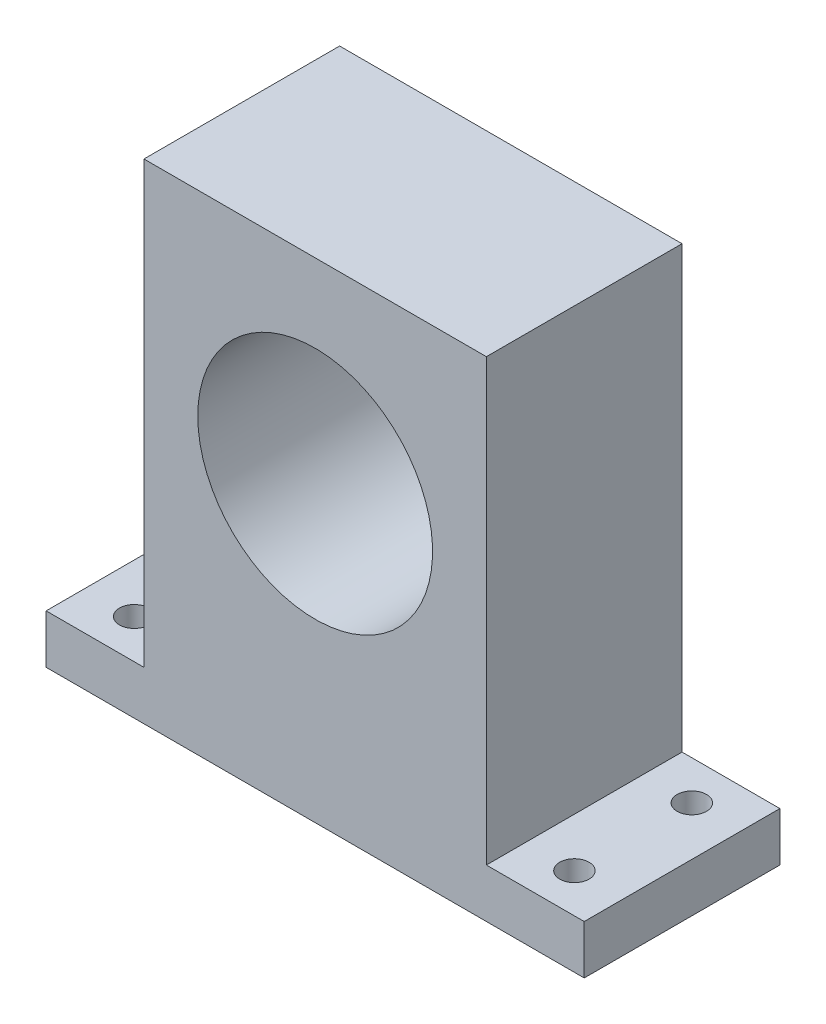
ISO-10303-21;
HEADER;
FILE_DESCRIPTION(('STEP AP214'),'2;1');
FILE_NAME('part.step','',(''),(''),'','','');
FILE_SCHEMA(('AUTOMOTIVE_DESIGN { 1 0 10303 214 1 1 1 1 }'));
ENDSEC;
DATA;
#1=APPLICATION_CONTEXT('core data for automotive mechanical design processes');
#2=APPLICATION_PROTOCOL_DEFINITION('international standard','automotive_design',2000,#1);
#3=PRODUCT_CONTEXT('',#1,'mechanical');
#4=PRODUCT('Part','Part','',(#3));
#5=PRODUCT_RELATED_PRODUCT_CATEGORY('part','',(#4));
#6=PRODUCT_DEFINITION_FORMATION('','',#4);
#7=PRODUCT_DEFINITION_CONTEXT('part definition',#1,'design');
#8=PRODUCT_DEFINITION('design','',#6,#7);
#9=PRODUCT_DEFINITION_SHAPE('','',#8);
#10=(LENGTH_UNIT() NAMED_UNIT(*) SI_UNIT(.MILLI.,.METRE.));
#11=(NAMED_UNIT(*) PLANE_ANGLE_UNIT() SI_UNIT($,.RADIAN.));
#12=(NAMED_UNIT(*) SI_UNIT($,.STERADIAN.) SOLID_ANGLE_UNIT());
#13=UNCERTAINTY_MEASURE_WITH_UNIT(LENGTH_MEASURE(1.E-05),#10,'distance_accuracy_value','');
#14=(GEOMETRIC_REPRESENTATION_CONTEXT(3) GLOBAL_UNCERTAINTY_ASSIGNED_CONTEXT((#13)) GLOBAL_UNIT_ASSIGNED_CONTEXT((#10,
#11,#12)) REPRESENTATION_CONTEXT('',''));
#15=CARTESIAN_POINT('',(0.,0.,0.));
#16=DIRECTION('',(0.,0.,1.));
#17=DIRECTION('',(1.,0.,0.));
#18=AXIS2_PLACEMENT_3D('',#15,#16,#17);
#19=CARTESIAN_POINT('',(-17.5,25.,20.));
#20=DIRECTION('',(1.,0.,0.));
#21=DIRECTION('',(0.,1.,0.));
#22=AXIS2_PLACEMENT_3D('',#19,#20,#21);
#23=PLANE('',#22);
#24=DIRECTION('',(0.,0.,-1.));
#25=VECTOR('',#24,1.);
#26=CARTESIAN_POINT('',(-17.5,-20.,0.));
#27=LINE('',#26,#25);
#28=CARTESIAN_POINT('',(-17.5,-20.,20.));
#29=VERTEX_POINT('',#28);
#30=CARTESIAN_POINT('',(-17.5,-20.,0.));
#31=VERTEX_POINT('',#30);
#32=EDGE_CURVE('E48',#29,#31,#27,.T.);
#33=ORIENTED_EDGE('',*,*,#32,.F.);
#34=DIRECTION('',(0.,-1.,0.));
#35=VECTOR('',#34,1.);
#36=CARTESIAN_POINT('',(-17.5,25.,20.));
#37=LINE('',#36,#35);
#38=CARTESIAN_POINT('',(-17.5,25.,20.));
#39=VERTEX_POINT('',#38);
#40=EDGE_CURVE('E158',#39,#29,#37,.T.);
#41=ORIENTED_EDGE('',*,*,#40,.F.);
#42=DIRECTION('',(0.,0.,-1.));
#43=VECTOR('',#42,1.);
#44=CARTESIAN_POINT('',(-17.5,25.,20.));
#45=LINE('',#44,#43);
#46=CARTESIAN_POINT('',(-17.5,25.,0.));
#47=VERTEX_POINT('',#46);
#48=EDGE_CURVE('E41',#39,#47,#45,.T.);
#49=ORIENTED_EDGE('',*,*,#48,.T.);
#50=DIRECTION('',(0.,-1.,0.));
#51=VECTOR('',#50,1.);
#52=CARTESIAN_POINT('',(-17.5,25.,0.));
#53=LINE('',#52,#51);
#54=EDGE_CURVE('E111',#47,#31,#53,.T.);
#55=ORIENTED_EDGE('',*,*,#54,.T.);
#56=EDGE_LOOP('',(#33,#41,#49,#55));
#57=FACE_BOUND('',#56,.T.);
#58=ADVANCED_FACE('F33',(#57),#23,.F.);
#59=CARTESIAN_POINT('',(17.5,25.,20.));
#60=DIRECTION('',(-1.,0.,0.));
#61=DIRECTION('',(0.,-1.,0.));
#62=AXIS2_PLACEMENT_3D('',#59,#60,#61);
#63=PLANE('',#62);
#64=DIRECTION('',(0.,0.,1.));
#65=VECTOR('',#64,1.);
#66=CARTESIAN_POINT('',(17.5,-20.,20.));
#67=LINE('',#66,#65);
#68=CARTESIAN_POINT('',(17.5,-20.,0.));
#69=VERTEX_POINT('',#68);
#70=CARTESIAN_POINT('',(17.5,-20.,20.));
#71=VERTEX_POINT('',#70);
#72=EDGE_CURVE('E56',#69,#71,#67,.T.);
#73=ORIENTED_EDGE('',*,*,#72,.F.);
#74=DIRECTION('',(0.,1.,0.));
#75=VECTOR('',#74,1.);
#76=CARTESIAN_POINT('',(17.5,25.,0.));
#77=LINE('',#76,#75);
#78=CARTESIAN_POINT('',(17.5,25.,0.));
#79=VERTEX_POINT('',#78);
#80=EDGE_CURVE('E154',#69,#79,#77,.T.);
#81=ORIENTED_EDGE('',*,*,#80,.T.);
#82=DIRECTION('',(0.,0.,-1.));
#83=VECTOR('',#82,1.);
#84=CARTESIAN_POINT('',(17.5,25.,20.));
#85=LINE('',#84,#83);
#86=CARTESIAN_POINT('',(17.5,25.,20.));
#87=VERTEX_POINT('',#86);
#88=EDGE_CURVE('E11',#87,#79,#85,.T.);
#89=ORIENTED_EDGE('',*,*,#88,.F.);
#90=DIRECTION('',(0.,1.,0.));
#91=VECTOR('',#90,1.);
#92=CARTESIAN_POINT('',(17.5,25.,20.));
#93=LINE('',#92,#91);
#94=EDGE_CURVE('E110',#71,#87,#93,.T.);
#95=ORIENTED_EDGE('',*,*,#94,.F.);
#96=EDGE_LOOP('',(#73,#81,#89,#95));
#97=FACE_BOUND('',#96,.T.);
#98=ADVANCED_FACE('F35',(#97),#63,.F.);
#99=CARTESIAN_POINT('',(-17.5,25.,20.));
#100=DIRECTION('',(0.,-1.,0.));
#101=DIRECTION('',(1.,0.,0.));
#102=AXIS2_PLACEMENT_3D('',#99,#100,#101);
#103=PLANE('',#102);
#104=DIRECTION('',(-1.,0.,0.));
#105=VECTOR('',#104,1.);
#106=CARTESIAN_POINT('',(-17.5,25.,0.));
#107=LINE('',#106,#105);
#108=EDGE_CURVE('E162',#79,#47,#107,.T.);
#109=ORIENTED_EDGE('',*,*,#108,.T.);
#110=ORIENTED_EDGE('',*,*,#48,.F.);
#111=DIRECTION('',(-1.,0.,0.));
#112=VECTOR('',#111,1.);
#113=CARTESIAN_POINT('',(-17.5,25.,20.));
#114=LINE('',#113,#112);
#115=EDGE_CURVE('E156',#87,#39,#114,.T.);
#116=ORIENTED_EDGE('',*,*,#115,.F.);
#117=ORIENTED_EDGE('',*,*,#88,.T.);
#118=EDGE_LOOP('',(#109,#110,#116,#117));
#119=FACE_BOUND('',#118,.T.);
#120=ADVANCED_FACE('F176',(#119),#103,.F.);
#121=CARTESIAN_POINT('',(-17.5,-25.,20.));
#122=DIRECTION('',(0.,1.,0.));
#123=DIRECTION('',(-1.,0.,0.));
#124=AXIS2_PLACEMENT_3D('',#121,#122,#123);
#125=PLANE('',#124);
#126=CARTESIAN_POINT('',(22.5,-25.,16.));
#127=DIRECTION('',(0.,1.,0.));
#128=DIRECTION('',(-1.,0.,0.));
#129=AXIS2_PLACEMENT_3D('',#126,#127,#128);
#130=CIRCLE('',#129,1.5);
#131=CARTESIAN_POINT('',(21.,-25.,16.));
#132=VERTEX_POINT('',#131);
#133=EDGE_CURVE('E214',#132,#132,#130,.T.);
#134=ORIENTED_EDGE('',*,*,#133,.T.);
#135=EDGE_LOOP('',(#134));
#136=FACE_BOUND('',#135,.T.);
#137=CARTESIAN_POINT('',(22.5,-25.,4.));
#138=DIRECTION('',(0.,1.,0.));
#139=DIRECTION('',(-1.,0.,0.));
#140=AXIS2_PLACEMENT_3D('',#137,#138,#139);
#141=CIRCLE('',#140,1.5);
#142=CARTESIAN_POINT('',(21.,-25.,4.));
#143=VERTEX_POINT('',#142);
#144=EDGE_CURVE('E218',#143,#143,#141,.T.);
#145=ORIENTED_EDGE('',*,*,#144,.T.);
#146=EDGE_LOOP('',(#145));
#147=FACE_BOUND('',#146,.T.);
#148=CARTESIAN_POINT('',(-22.5,-25.,16.));
#149=DIRECTION('',(0.,1.,0.));
#150=DIRECTION('',(-1.,0.,0.));
#151=AXIS2_PLACEMENT_3D('',#148,#149,#150);
#152=CIRCLE('',#151,1.5);
#153=CARTESIAN_POINT('',(-24.,-25.,16.));
#154=VERTEX_POINT('',#153);
#155=EDGE_CURVE('E222',#154,#154,#152,.T.);
#156=ORIENTED_EDGE('',*,*,#155,.T.);
#157=EDGE_LOOP('',(#156));
#158=FACE_BOUND('',#157,.T.);
#159=CARTESIAN_POINT('',(-22.5,-25.,4.));
#160=DIRECTION('',(0.,1.,0.));
#161=DIRECTION('',(-1.,0.,0.));
#162=AXIS2_PLACEMENT_3D('',#159,#160,#161);
#163=CIRCLE('',#162,1.5);
#164=CARTESIAN_POINT('',(-24.,-25.,4.));
#165=VERTEX_POINT('',#164);
#166=EDGE_CURVE('E225',#165,#165,#163,.T.);
#167=ORIENTED_EDGE('',*,*,#166,.T.);
#168=EDGE_LOOP('',(#167));
#169=FACE_BOUND('',#168,.T.);
#170=DIRECTION('',(1.,0.,0.));
#171=VECTOR('',#170,1.);
#172=CARTESIAN_POINT('',(-17.5,-25.,0.));
#173=LINE('',#172,#171);
#174=CARTESIAN_POINT('',(-27.5,-25.,0.));
#175=VERTEX_POINT('',#174);
#176=CARTESIAN_POINT('',(27.5,-25.,0.));
#177=VERTEX_POINT('',#176);
#178=EDGE_CURVE('E99',#175,#177,#173,.T.);
#179=ORIENTED_EDGE('',*,*,#178,.T.);
#180=DIRECTION('',(0.,0.,-1.));
#181=VECTOR('',#180,1.);
#182=CARTESIAN_POINT('',(27.5,-25.,20.));
#183=LINE('',#182,#181);
#184=CARTESIAN_POINT('',(27.5,-25.,20.));
#185=VERTEX_POINT('',#184);
#186=EDGE_CURVE('E142',#185,#177,#183,.T.);
#187=ORIENTED_EDGE('',*,*,#186,.F.);
#188=DIRECTION('',(1.,0.,0.));
#189=VECTOR('',#188,1.);
#190=CARTESIAN_POINT('',(-17.5,-25.,20.));
#191=LINE('',#190,#189);
#192=CARTESIAN_POINT('',(-27.5,-25.,20.));
#193=VERTEX_POINT('',#192);
#194=EDGE_CURVE('E116',#193,#185,#191,.T.);
#195=ORIENTED_EDGE('',*,*,#194,.F.);
#196=DIRECTION('',(0.,0.,1.));
#197=VECTOR('',#196,1.);
#198=CARTESIAN_POINT('',(-27.5,-25.,0.));
#199=LINE('',#198,#197);
#200=EDGE_CURVE('E114',#175,#193,#199,.T.);
#201=ORIENTED_EDGE('',*,*,#200,.F.);
#202=EDGE_LOOP('',(#179,#187,#195,#201));
#203=FACE_BOUND('',#202,.T.);
#204=ADVANCED_FACE('F115',(#136,#147,#158,#169,#203),#125,.F.);
#205=CARTESIAN_POINT('',(0.,0.,20.));
#206=DIRECTION('',(0.,0.,1.));
#207=DIRECTION('',(1.,0.,0.));
#208=AXIS2_PLACEMENT_3D('',#205,#206,#207);
#209=PLANE('',#208);
#210=CARTESIAN_POINT('',(0.,4.99999999999999,20.));
#211=DIRECTION('',(0.,0.,-1.));
#212=DIRECTION('',(-1.,0.,0.));
#213=AXIS2_PLACEMENT_3D('',#210,#211,#212);
#214=CIRCLE('',#213,12.);
#215=CARTESIAN_POINT('',(-12.,4.99999999999999,20.));
#216=VERTEX_POINT('',#215);
#217=EDGE_CURVE('E126',#216,#216,#214,.T.);
#218=ORIENTED_EDGE('',*,*,#217,.T.);
#219=EDGE_LOOP('',(#218));
#220=FACE_BOUND('',#219,.T.);
#221=ORIENTED_EDGE('',*,*,#194,.T.);
#222=DIRECTION('',(0.,-1.,0.));
#223=VECTOR('',#222,1.);
#224=CARTESIAN_POINT('',(27.5,-25.,20.));
#225=LINE('',#224,#223);
#226=CARTESIAN_POINT('',(27.5,-20.,20.));
#227=VERTEX_POINT('',#226);
#228=EDGE_CURVE('E139',#227,#185,#225,.T.);
#229=ORIENTED_EDGE('',*,*,#228,.F.);
#230=DIRECTION('',(-1.,0.,0.));
#231=VECTOR('',#230,1.);
#232=CARTESIAN_POINT('',(27.5,-20.,20.));
#233=LINE('',#232,#231);
#234=EDGE_CURVE('E147',#227,#71,#233,.T.);
#235=ORIENTED_EDGE('',*,*,#234,.T.);
#236=ORIENTED_EDGE('',*,*,#94,.T.);
#237=ORIENTED_EDGE('',*,*,#115,.T.);
#238=ORIENTED_EDGE('',*,*,#40,.T.);
#239=DIRECTION('',(1.,0.,0.));
#240=VECTOR('',#239,1.);
#241=CARTESIAN_POINT('',(-27.5,-20.,20.));
#242=LINE('',#241,#240);
#243=CARTESIAN_POINT('',(-27.5,-20.,20.));
#244=VERTEX_POINT('',#243);
#245=EDGE_CURVE('E136',#244,#29,#242,.T.);
#246=ORIENTED_EDGE('',*,*,#245,.F.);
#247=DIRECTION('',(0.,1.,0.));
#248=VECTOR('',#247,1.);
#249=CARTESIAN_POINT('',(-27.5,-25.,20.));
#250=LINE('',#249,#248);
#251=EDGE_CURVE('E119',#193,#244,#250,.T.);
#252=ORIENTED_EDGE('',*,*,#251,.F.);
#253=EDGE_LOOP('',(#221,#229,#235,#236,#237,#238,#246,#252));
#254=FACE_BOUND('',#253,.T.);
#255=ADVANCED_FACE('F174',(#220,#254),#209,.T.);
#256=CARTESIAN_POINT('',(0.,0.,0.));
#257=DIRECTION('',(0.,0.,1.));
#258=DIRECTION('',(1.,0.,0.));
#259=AXIS2_PLACEMENT_3D('',#256,#257,#258);
#260=PLANE('',#259);
#261=CARTESIAN_POINT('',(0.,4.99999999999999,0.));
#262=DIRECTION('',(0.,0.,-1.));
#263=DIRECTION('',(-1.,0.,0.));
#264=AXIS2_PLACEMENT_3D('',#261,#262,#263);
#265=CIRCLE('',#264,12.);
#266=CARTESIAN_POINT('',(-12.,4.99999999999999,0.));
#267=VERTEX_POINT('',#266);
#268=EDGE_CURVE('E129',#267,#267,#265,.T.);
#269=ORIENTED_EDGE('',*,*,#268,.F.);
#270=EDGE_LOOP('',(#269));
#271=FACE_BOUND('',#270,.T.);
#272=ORIENTED_EDGE('',*,*,#80,.F.);
#273=DIRECTION('',(-1.,0.,0.));
#274=VECTOR('',#273,1.);
#275=CARTESIAN_POINT('',(27.5,-20.,0.));
#276=LINE('',#275,#274);
#277=CARTESIAN_POINT('',(27.5,-20.,0.));
#278=VERTEX_POINT('',#277);
#279=EDGE_CURVE('E151',#278,#69,#276,.T.);
#280=ORIENTED_EDGE('',*,*,#279,.F.);
#281=DIRECTION('',(0.,1.,0.));
#282=VECTOR('',#281,1.);
#283=CARTESIAN_POINT('',(27.5,-25.,0.));
#284=LINE('',#283,#282);
#285=EDGE_CURVE('E106',#177,#278,#284,.T.);
#286=ORIENTED_EDGE('',*,*,#285,.F.);
#287=ORIENTED_EDGE('',*,*,#178,.F.);
#288=DIRECTION('',(0.,-1.,0.));
#289=VECTOR('',#288,1.);
#290=CARTESIAN_POINT('',(-27.5,-25.,0.));
#291=LINE('',#290,#289);
#292=CARTESIAN_POINT('',(-27.5,-20.,0.));
#293=VERTEX_POINT('',#292);
#294=EDGE_CURVE('E104',#293,#175,#291,.T.);
#295=ORIENTED_EDGE('',*,*,#294,.F.);
#296=DIRECTION('',(1.,0.,0.));
#297=VECTOR('',#296,1.);
#298=CARTESIAN_POINT('',(-27.5,-20.,0.));
#299=LINE('',#298,#297);
#300=EDGE_CURVE('E133',#293,#31,#299,.T.);
#301=ORIENTED_EDGE('',*,*,#300,.T.);
#302=ORIENTED_EDGE('',*,*,#54,.F.);
#303=ORIENTED_EDGE('',*,*,#108,.F.);
#304=EDGE_LOOP('',(#272,#280,#286,#287,#295,#301,#302,#303));
#305=FACE_BOUND('',#304,.T.);
#306=ADVANCED_FACE('F101',(#271,#305),#260,.F.);
#307=CARTESIAN_POINT('',(27.5,-20.,20.));
#308=DIRECTION('',(0.,-1.,0.));
#309=DIRECTION('',(1.,0.,0.));
#310=AXIS2_PLACEMENT_3D('',#307,#308,#309);
#311=PLANE('',#310);
#312=CARTESIAN_POINT('',(22.5,-20.,16.));
#313=DIRECTION('',(0.,1.,0.));
#314=DIRECTION('',(-1.,0.,0.));
#315=AXIS2_PLACEMENT_3D('',#312,#313,#314);
#316=CIRCLE('',#315,1.5);
#317=CARTESIAN_POINT('',(21.,-20.,16.));
#318=VERTEX_POINT('',#317);
#319=EDGE_CURVE('E373',#318,#318,#316,.T.);
#320=ORIENTED_EDGE('',*,*,#319,.F.);
#321=EDGE_LOOP('',(#320));
#322=FACE_BOUND('',#321,.T.);
#323=CARTESIAN_POINT('',(22.5,-20.,4.));
#324=DIRECTION('',(0.,1.,0.));
#325=DIRECTION('',(-1.,0.,0.));
#326=AXIS2_PLACEMENT_3D('',#323,#324,#325);
#327=CIRCLE('',#326,1.5);
#328=CARTESIAN_POINT('',(21.,-20.,4.));
#329=VERTEX_POINT('',#328);
#330=EDGE_CURVE('E368',#329,#329,#327,.T.);
#331=ORIENTED_EDGE('',*,*,#330,.F.);
#332=EDGE_LOOP('',(#331));
#333=FACE_BOUND('',#332,.T.);
#334=ORIENTED_EDGE('',*,*,#72,.T.);
#335=ORIENTED_EDGE('',*,*,#234,.F.);
#336=DIRECTION('',(0.,0.,1.));
#337=VECTOR('',#336,1.);
#338=CARTESIAN_POINT('',(27.5,-20.,20.));
#339=LINE('',#338,#337);
#340=EDGE_CURVE('E145',#278,#227,#339,.T.);
#341=ORIENTED_EDGE('',*,*,#340,.F.);
#342=ORIENTED_EDGE('',*,*,#279,.T.);
#343=EDGE_LOOP('',(#334,#335,#341,#342));
#344=FACE_BOUND('',#343,.T.);
#345=ADVANCED_FACE('F179',(#322,#333,#344),#311,.F.);
#346=CARTESIAN_POINT('',(27.5,0.,0.));
#347=DIRECTION('',(-1.,0.,0.));
#348=DIRECTION('',(0.,0.,1.));
#349=AXIS2_PLACEMENT_3D('',#346,#347,#348);
#350=PLANE('',#349);
#351=ORIENTED_EDGE('',*,*,#228,.T.);
#352=ORIENTED_EDGE('',*,*,#186,.T.);
#353=ORIENTED_EDGE('',*,*,#285,.T.);
#354=ORIENTED_EDGE('',*,*,#340,.T.);
#355=EDGE_LOOP('',(#351,#352,#353,#354));
#356=FACE_BOUND('',#355,.T.);
#357=ADVANCED_FACE('F183',(#356),#350,.F.);
#358=CARTESIAN_POINT('',(-27.5,-20.,0.));
#359=DIRECTION('',(0.,-1.,0.));
#360=DIRECTION('',(1.,0.,0.));
#361=AXIS2_PLACEMENT_3D('',#358,#359,#360);
#362=PLANE('',#361);
#363=CARTESIAN_POINT('',(-22.5,-20.,16.));
#364=DIRECTION('',(0.,1.,0.));
#365=DIRECTION('',(-1.,0.,0.));
#366=AXIS2_PLACEMENT_3D('',#363,#364,#365);
#367=CIRCLE('',#366,1.5);
#368=CARTESIAN_POINT('',(-24.,-20.,16.));
#369=VERTEX_POINT('',#368);
#370=EDGE_CURVE('E233',#369,#369,#367,.T.);
#371=ORIENTED_EDGE('',*,*,#370,.F.);
#372=EDGE_LOOP('',(#371));
#373=FACE_BOUND('',#372,.T.);
#374=CARTESIAN_POINT('',(-22.5,-20.,4.));
#375=DIRECTION('',(0.,1.,0.));
#376=DIRECTION('',(-1.,0.,0.));
#377=AXIS2_PLACEMENT_3D('',#374,#375,#376);
#378=CIRCLE('',#377,1.5);
#379=CARTESIAN_POINT('',(-24.,-20.,4.));
#380=VERTEX_POINT('',#379);
#381=EDGE_CURVE('E227',#380,#380,#378,.T.);
#382=ORIENTED_EDGE('',*,*,#381,.F.);
#383=EDGE_LOOP('',(#382));
#384=FACE_BOUND('',#383,.T.);
#385=ORIENTED_EDGE('',*,*,#32,.T.);
#386=ORIENTED_EDGE('',*,*,#300,.F.);
#387=DIRECTION('',(0.,0.,-1.));
#388=VECTOR('',#387,1.);
#389=CARTESIAN_POINT('',(-27.5,-20.,0.));
#390=LINE('',#389,#388);
#391=EDGE_CURVE('E123',#244,#293,#390,.T.);
#392=ORIENTED_EDGE('',*,*,#391,.F.);
#393=ORIENTED_EDGE('',*,*,#245,.T.);
#394=EDGE_LOOP('',(#385,#386,#392,#393));
#395=FACE_BOUND('',#394,.T.);
#396=ADVANCED_FACE('F171',(#373,#384,#395),#362,.F.);
#397=CARTESIAN_POINT('',(-27.5,0.,0.));
#398=DIRECTION('',(1.,0.,0.));
#399=DIRECTION('',(0.,1.,0.));
#400=AXIS2_PLACEMENT_3D('',#397,#398,#399);
#401=PLANE('',#400);
#402=ORIENTED_EDGE('',*,*,#294,.T.);
#403=ORIENTED_EDGE('',*,*,#200,.T.);
#404=ORIENTED_EDGE('',*,*,#251,.T.);
#405=ORIENTED_EDGE('',*,*,#391,.T.);
#406=EDGE_LOOP('',(#402,#403,#404,#405));
#407=FACE_BOUND('',#406,.T.);
#408=ADVANCED_FACE('F121',(#407),#401,.F.);
#409=CARTESIAN_POINT('',(0.,4.99999999999999,20.));
#410=DIRECTION('',(0.,0.,-1.));
#411=DIRECTION('',(-1.,0.,0.));
#412=AXIS2_PLACEMENT_3D('',#409,#410,#411);
#413=CYLINDRICAL_SURFACE('',#412,12.);
#414=ORIENTED_EDGE('',*,*,#217,.F.);
#415=EDGE_LOOP('',(#414));
#416=FACE_BOUND('',#415,.T.);
#417=ORIENTED_EDGE('',*,*,#268,.T.);
#418=EDGE_LOOP('',(#417));
#419=FACE_BOUND('',#418,.T.);
#420=ADVANCED_FACE('F238',(#416,#419),#413,.F.);
#421=CARTESIAN_POINT('',(-22.5,-25.,4.));
#422=DIRECTION('',(0.,1.,0.));
#423=DIRECTION('',(-1.,0.,0.));
#424=AXIS2_PLACEMENT_3D('',#421,#422,#423);
#425=CYLINDRICAL_SURFACE('',#424,1.5);
#426=ORIENTED_EDGE('',*,*,#166,.F.);
#427=EDGE_LOOP('',(#426));
#428=FACE_BOUND('',#427,.T.);
#429=ORIENTED_EDGE('',*,*,#381,.T.);
#430=EDGE_LOOP('',(#429));
#431=FACE_BOUND('',#430,.T.);
#432=ADVANCED_FACE('F241',(#428,#431),#425,.F.);
#433=CARTESIAN_POINT('',(-22.5,-25.,16.));
#434=DIRECTION('',(0.,1.,0.));
#435=DIRECTION('',(-1.,0.,0.));
#436=AXIS2_PLACEMENT_3D('',#433,#434,#435);
#437=CYLINDRICAL_SURFACE('',#436,1.5);
#438=ORIENTED_EDGE('',*,*,#155,.F.);
#439=EDGE_LOOP('',(#438));
#440=FACE_BOUND('',#439,.T.);
#441=ORIENTED_EDGE('',*,*,#370,.T.);
#442=EDGE_LOOP('',(#441));
#443=FACE_BOUND('',#442,.T.);
#444=ADVANCED_FACE('F279',(#440,#443),#437,.F.);
#445=CARTESIAN_POINT('',(22.5,-25.,4.));
#446=DIRECTION('',(0.,1.,0.));
#447=DIRECTION('',(-1.,0.,0.));
#448=AXIS2_PLACEMENT_3D('',#445,#446,#447);
#449=CYLINDRICAL_SURFACE('',#448,1.5);
#450=ORIENTED_EDGE('',*,*,#144,.F.);
#451=EDGE_LOOP('',(#450));
#452=FACE_BOUND('',#451,.T.);
#453=ORIENTED_EDGE('',*,*,#330,.T.);
#454=EDGE_LOOP('',(#453));
#455=FACE_BOUND('',#454,.T.);
#456=ADVANCED_FACE('F269',(#452,#455),#449,.F.);
#457=CARTESIAN_POINT('',(22.5,-25.,16.));
#458=DIRECTION('',(0.,1.,0.));
#459=DIRECTION('',(-1.,0.,0.));
#460=AXIS2_PLACEMENT_3D('',#457,#458,#459);
#461=CYLINDRICAL_SURFACE('',#460,1.5);
#462=ORIENTED_EDGE('',*,*,#133,.F.);
#463=EDGE_LOOP('',(#462));
#464=FACE_BOUND('',#463,.T.);
#465=ORIENTED_EDGE('',*,*,#319,.T.);
#466=EDGE_LOOP('',(#465));
#467=FACE_BOUND('',#466,.T.);
#468=ADVANCED_FACE('F265',(#464,#467),#461,.F.);
#469=CLOSED_SHELL('',(#58,#98,#120,#204,#255,#306,#345,#357,#396,#408,#420,#432,#444,#456,#468));
#470=MANIFOLD_SOLID_BREP('B2',#469);
#471=ADVANCED_BREP_SHAPE_REPRESENTATION('',(#18,#470),#14);
#472=SHAPE_DEFINITION_REPRESENTATION(#9,#471);
ENDSEC;
END-ISO-10303-21;
